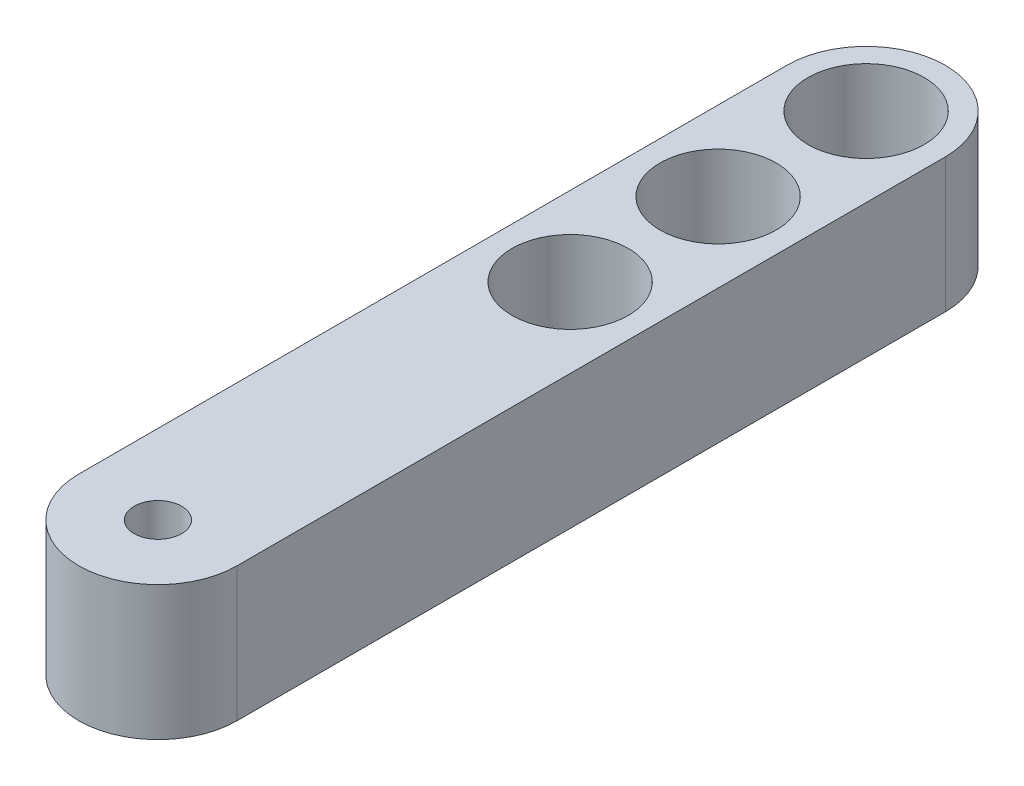
ISO-10303-21;
HEADER;
FILE_DESCRIPTION(('STEP AP214'),'2;1');
FILE_NAME('part.step','',(''),(''),'','','');
FILE_SCHEMA(('AUTOMOTIVE_DESIGN { 1 0 10303 214 1 1 1 1 }'));
ENDSEC;
DATA;
#1=APPLICATION_CONTEXT('core data for automotive mechanical design processes');
#2=APPLICATION_PROTOCOL_DEFINITION('international standard','automotive_design',2000,#1);
#3=PRODUCT_CONTEXT('',#1,'mechanical');
#4=PRODUCT('Part','Part','',(#3));
#5=PRODUCT_RELATED_PRODUCT_CATEGORY('part','',(#4));
#6=PRODUCT_DEFINITION_FORMATION('','',#4);
#7=PRODUCT_DEFINITION_CONTEXT('part definition',#1,'design');
#8=PRODUCT_DEFINITION('design','',#6,#7);
#9=PRODUCT_DEFINITION_SHAPE('','',#8);
#10=(LENGTH_UNIT() NAMED_UNIT(*) SI_UNIT(.MILLI.,.METRE.));
#11=(NAMED_UNIT(*) PLANE_ANGLE_UNIT() SI_UNIT($,.RADIAN.));
#12=(NAMED_UNIT(*) SI_UNIT($,.STERADIAN.) SOLID_ANGLE_UNIT());
#13=UNCERTAINTY_MEASURE_WITH_UNIT(LENGTH_MEASURE(1.E-05),#10,'distance_accuracy_value','');
#14=(GEOMETRIC_REPRESENTATION_CONTEXT(3) GLOBAL_UNCERTAINTY_ASSIGNED_CONTEXT((#13)) GLOBAL_UNIT_ASSIGNED_CONTEXT((#10,
#11,#12)) REPRESENTATION_CONTEXT('',''));
#15=CARTESIAN_POINT('',(0.,0.,0.));
#16=DIRECTION('',(0.,0.,1.));
#17=DIRECTION('',(1.,0.,0.));
#18=AXIS2_PLACEMENT_3D('',#15,#16,#17);
#19=CARTESIAN_POINT('',(0.,6.35,-33.5));
#20=DIRECTION('',(0.,1.,0.));
#21=DIRECTION('',(0.,0.,1.));
#22=AXIS2_PLACEMENT_3D('',#19,#20,#21);
#23=PLANE('',#22);
#24=CARTESIAN_POINT('',(0.,6.35,-19.5));
#25=DIRECTION('',(0.,1.,0.));
#26=DIRECTION('',(0.,0.,1.));
#27=AXIS2_PLACEMENT_3D('',#24,#25,#26);
#28=CIRCLE('',#27,2.74999999999999);
#29=CARTESIAN_POINT('',(0.,6.35,-16.75));
#30=VERTEX_POINT('',#29);
#31=EDGE_CURVE('E144',#30,#30,#28,.T.);
#32=ORIENTED_EDGE('',*,*,#31,.F.);
#33=EDGE_LOOP('',(#32));
#34=FACE_BOUND('',#33,.T.);
#35=CARTESIAN_POINT('',(0.,6.35,-26.5));
#36=DIRECTION('',(0.,1.,0.));
#37=DIRECTION('',(0.,0.,1.));
#38=AXIS2_PLACEMENT_3D('',#35,#36,#37);
#39=CIRCLE('',#38,2.74999999999999);
#40=CARTESIAN_POINT('',(0.,6.35,-23.75));
#41=VERTEX_POINT('',#40);
#42=EDGE_CURVE('E152',#41,#41,#39,.T.);
#43=ORIENTED_EDGE('',*,*,#42,.F.);
#44=EDGE_LOOP('',(#43));
#45=FACE_BOUND('',#44,.T.);
#46=CARTESIAN_POINT('',(0.,6.35,0.));
#47=DIRECTION('',(0.,1.,0.));
#48=DIRECTION('',(0.,0.,1.));
#49=AXIS2_PLACEMENT_3D('',#46,#47,#48);
#50=CIRCLE('',#49,1.125);
#51=CARTESIAN_POINT('',(0.,6.35,1.125));
#52=VERTEX_POINT('',#51);
#53=EDGE_CURVE('E114',#52,#52,#50,.T.);
#54=ORIENTED_EDGE('',*,*,#53,.F.);
#55=EDGE_LOOP('',(#54));
#56=FACE_BOUND('',#55,.T.);
#57=CARTESIAN_POINT('',(0.,6.35,-33.5));
#58=DIRECTION('',(0.,1.,0.));
#59=DIRECTION('',(0.,0.,1.));
#60=AXIS2_PLACEMENT_3D('',#57,#58,#59);
#61=CIRCLE('',#60,3.75);
#62=CARTESIAN_POINT('',(3.75,6.35,-33.5));
#63=VERTEX_POINT('',#62);
#64=CARTESIAN_POINT('',(-3.75,6.35,-33.5));
#65=VERTEX_POINT('',#64);
#66=EDGE_CURVE('E94',#63,#65,#61,.T.);
#67=ORIENTED_EDGE('',*,*,#66,.T.);
#68=DIRECTION('',(0.,0.,1.));
#69=VECTOR('',#68,1.);
#70=CARTESIAN_POINT('',(-3.75,6.35,-33.5));
#71=LINE('',#70,#69);
#72=CARTESIAN_POINT('',(-3.75,6.35,0.));
#73=VERTEX_POINT('',#72);
#74=EDGE_CURVE('E89',#65,#73,#71,.T.);
#75=ORIENTED_EDGE('',*,*,#74,.T.);
#76=CARTESIAN_POINT('',(0.,6.35,0.));
#77=DIRECTION('',(0.,1.,0.));
#78=DIRECTION('',(0.,0.,1.));
#79=AXIS2_PLACEMENT_3D('',#76,#77,#78);
#80=CIRCLE('',#79,3.75);
#81=CARTESIAN_POINT('',(3.75,6.35,0.));
#82=VERTEX_POINT('',#81);
#83=EDGE_CURVE('E92',#73,#82,#80,.T.);
#84=ORIENTED_EDGE('',*,*,#83,.T.);
#85=DIRECTION('',(0.,0.,-1.));
#86=VECTOR('',#85,1.);
#87=CARTESIAN_POINT('',(3.75,6.35,0.));
#88=LINE('',#87,#86);
#89=EDGE_CURVE('E59',#82,#63,#88,.T.);
#90=ORIENTED_EDGE('',*,*,#89,.T.);
#91=EDGE_LOOP('',(#67,#75,#84,#90));
#92=FACE_BOUND('',#91,.T.);
#93=CARTESIAN_POINT('',(0.,6.35,-33.5));
#94=DIRECTION('',(0.,1.,0.));
#95=DIRECTION('',(0.,0.,1.));
#96=AXIS2_PLACEMENT_3D('',#93,#94,#95);
#97=CIRCLE('',#96,2.74999999999999);
#98=CARTESIAN_POINT('',(0.,6.35,-30.75));
#99=VERTEX_POINT('',#98);
#100=EDGE_CURVE('E136',#99,#99,#97,.T.);
#101=ORIENTED_EDGE('',*,*,#100,.F.);
#102=EDGE_LOOP('',(#101));
#103=FACE_BOUND('',#102,.T.);
#104=ADVANCED_FACE('F41',(#34,#45,#56,#92,#103),#23,.T.);
#105=CARTESIAN_POINT('',(0.,0.,-33.5));
#106=DIRECTION('',(0.,1.,0.));
#107=DIRECTION('',(0.,0.,1.));
#108=AXIS2_PLACEMENT_3D('',#105,#106,#107);
#109=PLANE('',#108);
#110=CARTESIAN_POINT('',(0.,0.,-19.5));
#111=DIRECTION('',(0.,1.,0.));
#112=DIRECTION('',(0.,0.,1.));
#113=AXIS2_PLACEMENT_3D('',#110,#111,#112);
#114=CIRCLE('',#113,2.74999999999999);
#115=CARTESIAN_POINT('',(0.,0.,-16.75));
#116=VERTEX_POINT('',#115);
#117=EDGE_CURVE('E156',#116,#116,#114,.T.);
#118=ORIENTED_EDGE('',*,*,#117,.T.);
#119=EDGE_LOOP('',(#118));
#120=FACE_BOUND('',#119,.T.);
#121=CARTESIAN_POINT('',(0.,0.,-26.5));
#122=DIRECTION('',(0.,1.,0.));
#123=DIRECTION('',(0.,0.,1.));
#124=AXIS2_PLACEMENT_3D('',#121,#122,#123);
#125=CIRCLE('',#124,2.74999999999999);
#126=CARTESIAN_POINT('',(0.,0.,-23.75));
#127=VERTEX_POINT('',#126);
#128=EDGE_CURVE('E148',#127,#127,#125,.T.);
#129=ORIENTED_EDGE('',*,*,#128,.T.);
#130=EDGE_LOOP('',(#129));
#131=FACE_BOUND('',#130,.T.);
#132=CARTESIAN_POINT('',(0.,0.,-33.5));
#133=DIRECTION('',(0.,1.,0.));
#134=DIRECTION('',(0.,0.,1.));
#135=AXIS2_PLACEMENT_3D('',#132,#133,#134);
#136=CIRCLE('',#135,3.75);
#137=CARTESIAN_POINT('',(3.75,0.,-33.5));
#138=VERTEX_POINT('',#137);
#139=CARTESIAN_POINT('',(-3.75,0.,-33.5));
#140=VERTEX_POINT('',#139);
#141=EDGE_CURVE('E110',#138,#140,#136,.T.);
#142=ORIENTED_EDGE('',*,*,#141,.F.);
#143=DIRECTION('',(0.,0.,-1.));
#144=VECTOR('',#143,1.);
#145=CARTESIAN_POINT('',(3.75,0.,0.));
#146=LINE('',#145,#144);
#147=CARTESIAN_POINT('',(3.75,0.,0.));
#148=VERTEX_POINT('',#147);
#149=EDGE_CURVE('E82',#148,#138,#146,.T.);
#150=ORIENTED_EDGE('',*,*,#149,.F.);
#151=CARTESIAN_POINT('',(0.,0.,0.));
#152=DIRECTION('',(0.,1.,0.));
#153=DIRECTION('',(0.,0.,1.));
#154=AXIS2_PLACEMENT_3D('',#151,#152,#153);
#155=CIRCLE('',#154,3.75);
#156=CARTESIAN_POINT('',(-3.75,0.,0.));
#157=VERTEX_POINT('',#156);
#158=EDGE_CURVE('E76',#157,#148,#155,.T.);
#159=ORIENTED_EDGE('',*,*,#158,.F.);
#160=DIRECTION('',(0.,0.,1.));
#161=VECTOR('',#160,1.);
#162=CARTESIAN_POINT('',(-3.75,0.,-33.5));
#163=LINE('',#162,#161);
#164=EDGE_CURVE('E99',#140,#157,#163,.T.);
#165=ORIENTED_EDGE('',*,*,#164,.F.);
#166=EDGE_LOOP('',(#142,#150,#159,#165));
#167=FACE_BOUND('',#166,.T.);
#168=CARTESIAN_POINT('',(0.,0.,0.));
#169=DIRECTION('',(0.,1.,0.));
#170=DIRECTION('',(0.,0.,1.));
#171=AXIS2_PLACEMENT_3D('',#168,#169,#170);
#172=CIRCLE('',#171,1.125);
#173=CARTESIAN_POINT('',(0.,0.,1.125));
#174=VERTEX_POINT('',#173);
#175=EDGE_CURVE('E132',#174,#174,#172,.T.);
#176=ORIENTED_EDGE('',*,*,#175,.T.);
#177=EDGE_LOOP('',(#176));
#178=FACE_BOUND('',#177,.T.);
#179=CARTESIAN_POINT('',(0.,0.,-33.5));
#180=DIRECTION('',(0.,1.,0.));
#181=DIRECTION('',(0.,0.,1.));
#182=AXIS2_PLACEMENT_3D('',#179,#180,#181);
#183=CIRCLE('',#182,2.74999999999999);
#184=CARTESIAN_POINT('',(0.,0.,-30.75));
#185=VERTEX_POINT('',#184);
#186=EDGE_CURVE('E140',#185,#185,#183,.T.);
#187=ORIENTED_EDGE('',*,*,#186,.T.);
#188=EDGE_LOOP('',(#187));
#189=FACE_BOUND('',#188,.T.);
#190=ADVANCED_FACE('F127',(#120,#131,#167,#178,#189),#109,.F.);
#191=CARTESIAN_POINT('',(0.,6.35,-33.5));
#192=DIRECTION('',(0.,-1.,0.));
#193=DIRECTION('',(0.,0.,-1.));
#194=AXIS2_PLACEMENT_3D('',#191,#192,#193);
#195=CYLINDRICAL_SURFACE('',#194,3.75);
#196=ORIENTED_EDGE('',*,*,#141,.T.);
#197=DIRECTION('',(0.,-1.,0.));
#198=VECTOR('',#197,1.);
#199=CARTESIAN_POINT('',(-3.75,6.35,-33.5));
#200=LINE('',#199,#198);
#201=EDGE_CURVE('E11',#65,#140,#200,.T.);
#202=ORIENTED_EDGE('',*,*,#201,.F.);
#203=ORIENTED_EDGE('',*,*,#66,.F.);
#204=DIRECTION('',(0.,-1.,0.));
#205=VECTOR('',#204,1.);
#206=CARTESIAN_POINT('',(3.75,6.35,-33.5));
#207=LINE('',#206,#205);
#208=EDGE_CURVE('E106',#63,#138,#207,.T.);
#209=ORIENTED_EDGE('',*,*,#208,.T.);
#210=EDGE_LOOP('',(#196,#202,#203,#209));
#211=FACE_BOUND('',#210,.T.);
#212=ADVANCED_FACE('F43',(#211),#195,.T.);
#213=CARTESIAN_POINT('',(-3.75,6.35,-33.5));
#214=DIRECTION('',(1.,0.,0.));
#215=DIRECTION('',(0.,0.,-1.));
#216=AXIS2_PLACEMENT_3D('',#213,#214,#215);
#217=PLANE('',#216);
#218=ORIENTED_EDGE('',*,*,#164,.T.);
#219=DIRECTION('',(0.,-1.,0.));
#220=VECTOR('',#219,1.);
#221=CARTESIAN_POINT('',(-3.75,6.35,0.));
#222=LINE('',#221,#220);
#223=EDGE_CURVE('E51',#73,#157,#222,.T.);
#224=ORIENTED_EDGE('',*,*,#223,.F.);
#225=ORIENTED_EDGE('',*,*,#74,.F.);
#226=ORIENTED_EDGE('',*,*,#201,.T.);
#227=EDGE_LOOP('',(#218,#224,#225,#226));
#228=FACE_BOUND('',#227,.T.);
#229=ADVANCED_FACE('F98',(#228),#217,.F.);
#230=CARTESIAN_POINT('',(0.,6.35,0.));
#231=DIRECTION('',(0.,-1.,0.));
#232=DIRECTION('',(0.,0.,-1.));
#233=AXIS2_PLACEMENT_3D('',#230,#231,#232);
#234=CYLINDRICAL_SURFACE('',#233,3.75);
#235=ORIENTED_EDGE('',*,*,#158,.T.);
#236=DIRECTION('',(0.,-1.,0.));
#237=VECTOR('',#236,1.);
#238=CARTESIAN_POINT('',(3.75,6.35,0.));
#239=LINE('',#238,#237);
#240=EDGE_CURVE('E101',#82,#148,#239,.T.);
#241=ORIENTED_EDGE('',*,*,#240,.F.);
#242=ORIENTED_EDGE('',*,*,#83,.F.);
#243=ORIENTED_EDGE('',*,*,#223,.T.);
#244=EDGE_LOOP('',(#235,#241,#242,#243));
#245=FACE_BOUND('',#244,.T.);
#246=ADVANCED_FACE('F102',(#245),#234,.T.);
#247=CARTESIAN_POINT('',(3.75,6.35,0.));
#248=DIRECTION('',(-1.,0.,0.));
#249=DIRECTION('',(0.,0.,1.));
#250=AXIS2_PLACEMENT_3D('',#247,#248,#249);
#251=PLANE('',#250);
#252=ORIENTED_EDGE('',*,*,#149,.T.);
#253=ORIENTED_EDGE('',*,*,#208,.F.);
#254=ORIENTED_EDGE('',*,*,#89,.F.);
#255=ORIENTED_EDGE('',*,*,#240,.T.);
#256=EDGE_LOOP('',(#252,#253,#254,#255));
#257=FACE_BOUND('',#256,.T.);
#258=ADVANCED_FACE('F124',(#257),#251,.F.);
#259=CARTESIAN_POINT('',(0.,6.35,0.));
#260=DIRECTION('',(0.,-1.,0.));
#261=DIRECTION('',(0.,0.,-1.));
#262=AXIS2_PLACEMENT_3D('',#259,#260,#261);
#263=CYLINDRICAL_SURFACE('',#262,1.125);
#264=ORIENTED_EDGE('',*,*,#53,.T.);
#265=EDGE_LOOP('',(#264));
#266=FACE_BOUND('',#265,.T.);
#267=ORIENTED_EDGE('',*,*,#175,.F.);
#268=EDGE_LOOP('',(#267));
#269=FACE_BOUND('',#268,.T.);
#270=ADVANCED_FACE('F174',(#266,#269),#263,.F.);
#271=CARTESIAN_POINT('',(0.,6.35,-33.5));
#272=DIRECTION('',(0.,-1.,0.));
#273=DIRECTION('',(0.,0.,-1.));
#274=AXIS2_PLACEMENT_3D('',#271,#272,#273);
#275=CYLINDRICAL_SURFACE('',#274,2.74999999999999);
#276=ORIENTED_EDGE('',*,*,#100,.T.);
#277=EDGE_LOOP('',(#276));
#278=FACE_BOUND('',#277,.T.);
#279=ORIENTED_EDGE('',*,*,#186,.F.);
#280=EDGE_LOOP('',(#279));
#281=FACE_BOUND('',#280,.T.);
#282=ADVANCED_FACE('F177',(#278,#281),#275,.F.);
#283=CARTESIAN_POINT('',(0.,6.35,-26.5));
#284=DIRECTION('',(0.,-1.,0.));
#285=DIRECTION('',(0.,0.,-1.));
#286=AXIS2_PLACEMENT_3D('',#283,#284,#285);
#287=CYLINDRICAL_SURFACE('',#286,2.74999999999999);
#288=ORIENTED_EDGE('',*,*,#42,.T.);
#289=EDGE_LOOP('',(#288));
#290=FACE_BOUND('',#289,.T.);
#291=ORIENTED_EDGE('',*,*,#128,.F.);
#292=EDGE_LOOP('',(#291));
#293=FACE_BOUND('',#292,.T.);
#294=ADVANCED_FACE('F187',(#290,#293),#287,.F.);
#295=CARTESIAN_POINT('',(0.,6.35,-19.5));
#296=DIRECTION('',(0.,-1.,0.));
#297=DIRECTION('',(0.,0.,-1.));
#298=AXIS2_PLACEMENT_3D('',#295,#296,#297);
#299=CYLINDRICAL_SURFACE('',#298,2.74999999999999);
#300=ORIENTED_EDGE('',*,*,#31,.T.);
#301=EDGE_LOOP('',(#300));
#302=FACE_BOUND('',#301,.T.);
#303=ORIENTED_EDGE('',*,*,#117,.F.);
#304=EDGE_LOOP('',(#303));
#305=FACE_BOUND('',#304,.T.);
#306=ADVANCED_FACE('F164',(#302,#305),#299,.F.);
#307=CLOSED_SHELL('',(#104,#190,#212,#229,#246,#258,#270,#282,#294,#306));
#308=MANIFOLD_SOLID_BREP('B2',#307);
#309=ADVANCED_BREP_SHAPE_REPRESENTATION('',(#18,#308),#14);
#310=SHAPE_DEFINITION_REPRESENTATION(#9,#309);
ENDSEC;
END-ISO-10303-21;
